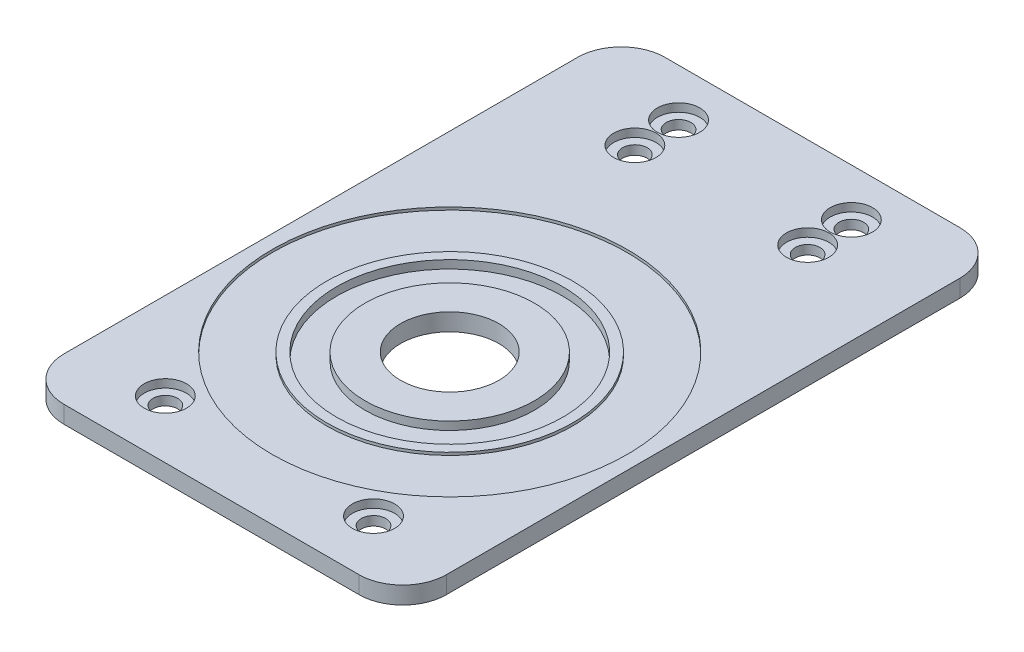
ISO-10303-21;
HEADER;
FILE_DESCRIPTION(('STEP AP214'),'2;1');
FILE_NAME('part.step','',(''),(''),'','','');
FILE_SCHEMA(('AUTOMOTIVE_DESIGN { 1 0 10303 214 1 1 1 1 }'));
ENDSEC;
DATA;
#1=APPLICATION_CONTEXT('core data for automotive mechanical design processes');
#2=APPLICATION_PROTOCOL_DEFINITION('international standard','automotive_design',2000,#1);
#3=PRODUCT_CONTEXT('',#1,'mechanical');
#4=PRODUCT('Part','Part','',(#3));
#5=PRODUCT_RELATED_PRODUCT_CATEGORY('part','',(#4));
#6=PRODUCT_DEFINITION_FORMATION('','',#4);
#7=PRODUCT_DEFINITION_CONTEXT('part definition',#1,'design');
#8=PRODUCT_DEFINITION('design','',#6,#7);
#9=PRODUCT_DEFINITION_SHAPE('','',#8);
#10=(LENGTH_UNIT() NAMED_UNIT(*) SI_UNIT(.MILLI.,.METRE.));
#11=(NAMED_UNIT(*) PLANE_ANGLE_UNIT() SI_UNIT($,.RADIAN.));
#12=(NAMED_UNIT(*) SI_UNIT($,.STERADIAN.) SOLID_ANGLE_UNIT());
#13=UNCERTAINTY_MEASURE_WITH_UNIT(LENGTH_MEASURE(1.E-05),#10,'distance_accuracy_value','');
#14=(GEOMETRIC_REPRESENTATION_CONTEXT(3) GLOBAL_UNCERTAINTY_ASSIGNED_CONTEXT((#13)) GLOBAL_UNIT_ASSIGNED_CONTEXT((#10,
#11,#12)) REPRESENTATION_CONTEXT('',''));
#15=CARTESIAN_POINT('',(0.,0.,0.));
#16=DIRECTION('',(0.,0.,1.));
#17=DIRECTION('',(1.,0.,0.));
#18=AXIS2_PLACEMENT_3D('',#15,#16,#17);
#19=CARTESIAN_POINT('',(15.8125,164.175,-49.7));
#20=DIRECTION('',(0.,1.,0.));
#21=DIRECTION('',(0.,0.,1.));
#22=AXIS2_PLACEMENT_3D('',#19,#20,#21);
#23=CYLINDRICAL_SURFACE('',#22,2.25);
#24=CARTESIAN_POINT('',(15.8125,164.175,-49.7));
#25=DIRECTION('',(0.,1.,0.));
#26=DIRECTION('',(0.,0.,1.));
#27=AXIS2_PLACEMENT_3D('',#24,#25,#26);
#28=CIRCLE('',#27,2.25);
#29=CARTESIAN_POINT('',(15.8125,164.175,-47.45));
#30=VERTEX_POINT('',#29);
#31=EDGE_CURVE('E190',#30,#30,#28,.T.);
#32=ORIENTED_EDGE('',*,*,#31,.F.);
#33=EDGE_LOOP('',(#32));
#34=FACE_BOUND('',#33,.T.);
#35=CARTESIAN_POINT('',(15.8125,165.85,-49.7));
#36=DIRECTION('',(0.,1.,0.));
#37=DIRECTION('',(0.,0.,1.));
#38=AXIS2_PLACEMENT_3D('',#35,#36,#37);
#39=CIRCLE('',#38,2.25);
#40=CARTESIAN_POINT('',(15.8125,165.85,-47.45));
#41=VERTEX_POINT('',#40);
#42=EDGE_CURVE('E238',#41,#41,#39,.F.);
#43=ORIENTED_EDGE('',*,*,#42,.F.);
#44=EDGE_LOOP('',(#43));
#45=FACE_BOUND('',#44,.T.);
#46=ADVANCED_FACE('F39',(#34,#45),#23,.F.);
#47=CARTESIAN_POINT('',(15.8125,164.175,-57.7));
#48=DIRECTION('',(0.,1.,0.));
#49=DIRECTION('',(0.,0.,1.));
#50=AXIS2_PLACEMENT_3D('',#47,#48,#49);
#51=CYLINDRICAL_SURFACE('',#50,2.25);
#52=CARTESIAN_POINT('',(15.8125,164.175,-57.7));
#53=DIRECTION('',(0.,1.,0.));
#54=DIRECTION('',(0.,0.,1.));
#55=AXIS2_PLACEMENT_3D('',#52,#53,#54);
#56=CIRCLE('',#55,2.25);
#57=CARTESIAN_POINT('',(15.8125,164.175,-55.45));
#58=VERTEX_POINT('',#57);
#59=EDGE_CURVE('E195',#58,#58,#56,.T.);
#60=ORIENTED_EDGE('',*,*,#59,.F.);
#61=EDGE_LOOP('',(#60));
#62=FACE_BOUND('',#61,.T.);
#63=CARTESIAN_POINT('',(15.8125,165.85,-57.7));
#64=DIRECTION('',(0.,1.,0.));
#65=DIRECTION('',(0.,0.,1.));
#66=AXIS2_PLACEMENT_3D('',#63,#64,#65);
#67=CIRCLE('',#66,2.25);
#68=CARTESIAN_POINT('',(15.8125,165.85,-55.45));
#69=VERTEX_POINT('',#68);
#70=EDGE_CURVE('E257',#69,#69,#67,.F.);
#71=ORIENTED_EDGE('',*,*,#70,.F.);
#72=EDGE_LOOP('',(#71));
#73=FACE_BOUND('',#72,.T.);
#74=ADVANCED_FACE('F310',(#62,#73),#51,.F.);
#75=CARTESIAN_POINT('',(-15.8125,164.175,-49.7));
#76=DIRECTION('',(0.,1.,0.));
#77=DIRECTION('',(0.,0.,1.));
#78=AXIS2_PLACEMENT_3D('',#75,#76,#77);
#79=CYLINDRICAL_SURFACE('',#78,2.25);
#80=CARTESIAN_POINT('',(-15.8125,164.175,-49.7));
#81=DIRECTION('',(0.,1.,0.));
#82=DIRECTION('',(0.,0.,1.));
#83=AXIS2_PLACEMENT_3D('',#80,#81,#82);
#84=CIRCLE('',#83,2.25);
#85=CARTESIAN_POINT('',(-15.8125,164.175,-47.45));
#86=VERTEX_POINT('',#85);
#87=EDGE_CURVE('E198',#86,#86,#84,.T.);
#88=ORIENTED_EDGE('',*,*,#87,.F.);
#89=EDGE_LOOP('',(#88));
#90=FACE_BOUND('',#89,.T.);
#91=CARTESIAN_POINT('',(-15.8125,165.85,-49.7));
#92=DIRECTION('',(0.,1.,0.));
#93=DIRECTION('',(0.,0.,1.));
#94=AXIS2_PLACEMENT_3D('',#91,#92,#93);
#95=CIRCLE('',#94,2.25);
#96=CARTESIAN_POINT('',(-15.8125,165.85,-47.45));
#97=VERTEX_POINT('',#96);
#98=EDGE_CURVE('E247',#97,#97,#95,.F.);
#99=ORIENTED_EDGE('',*,*,#98,.F.);
#100=EDGE_LOOP('',(#99));
#101=FACE_BOUND('',#100,.T.);
#102=ADVANCED_FACE('F305',(#90,#101),#79,.F.);
#103=CARTESIAN_POINT('',(-15.8125,164.175,-57.7));
#104=DIRECTION('',(0.,1.,0.));
#105=DIRECTION('',(0.,0.,1.));
#106=AXIS2_PLACEMENT_3D('',#103,#104,#105);
#107=CYLINDRICAL_SURFACE('',#106,2.25);
#108=CARTESIAN_POINT('',(-15.8125,164.175,-57.7));
#109=DIRECTION('',(0.,1.,0.));
#110=DIRECTION('',(0.,0.,1.));
#111=AXIS2_PLACEMENT_3D('',#108,#109,#110);
#112=CIRCLE('',#111,2.25);
#113=CARTESIAN_POINT('',(-15.8125,164.175,-55.45));
#114=VERTEX_POINT('',#113);
#115=EDGE_CURVE('E201',#114,#114,#112,.T.);
#116=ORIENTED_EDGE('',*,*,#115,.F.);
#117=EDGE_LOOP('',(#116));
#118=FACE_BOUND('',#117,.T.);
#119=CARTESIAN_POINT('',(-15.8125,165.85,-57.7));
#120=DIRECTION('',(0.,1.,0.));
#121=DIRECTION('',(0.,0.,1.));
#122=AXIS2_PLACEMENT_3D('',#119,#120,#121);
#123=CIRCLE('',#122,2.25);
#124=CARTESIAN_POINT('',(-15.8125,165.85,-55.45));
#125=VERTEX_POINT('',#124);
#126=EDGE_CURVE('E275',#125,#125,#123,.F.);
#127=ORIENTED_EDGE('',*,*,#126,.F.);
#128=EDGE_LOOP('',(#127));
#129=FACE_BOUND('',#128,.T.);
#130=ADVANCED_FACE('F295',(#118,#129),#107,.F.);
#131=CARTESIAN_POINT('',(19.05,164.175,33.));
#132=DIRECTION('',(0.,1.,0.));
#133=DIRECTION('',(0.,0.,1.));
#134=AXIS2_PLACEMENT_3D('',#131,#132,#133);
#135=CYLINDRICAL_SURFACE('',#134,2.25);
#136=CARTESIAN_POINT('',(19.05,164.175,33.));
#137=DIRECTION('',(0.,1.,0.));
#138=DIRECTION('',(0.,0.,1.));
#139=AXIS2_PLACEMENT_3D('',#136,#137,#138);
#140=CIRCLE('',#139,2.25);
#141=CARTESIAN_POINT('',(19.05,164.175,35.25));
#142=VERTEX_POINT('',#141);
#143=EDGE_CURVE('E204',#142,#142,#140,.T.);
#144=ORIENTED_EDGE('',*,*,#143,.F.);
#145=EDGE_LOOP('',(#144));
#146=FACE_BOUND('',#145,.T.);
#147=CARTESIAN_POINT('',(19.05,165.85,33.));
#148=DIRECTION('',(0.,1.,0.));
#149=DIRECTION('',(0.,0.,1.));
#150=AXIS2_PLACEMENT_3D('',#147,#148,#149);
#151=CIRCLE('',#150,2.25);
#152=CARTESIAN_POINT('',(19.05,165.85,35.25));
#153=VERTEX_POINT('',#152);
#154=EDGE_CURVE('E283',#153,#153,#151,.F.);
#155=ORIENTED_EDGE('',*,*,#154,.F.);
#156=EDGE_LOOP('',(#155));
#157=FACE_BOUND('',#156,.T.);
#158=ADVANCED_FACE('F292',(#146,#157),#135,.F.);
#159=CARTESIAN_POINT('',(-19.05,164.175,33.));
#160=DIRECTION('',(0.,1.,0.));
#161=DIRECTION('',(0.,0.,1.));
#162=AXIS2_PLACEMENT_3D('',#159,#160,#161);
#163=CYLINDRICAL_SURFACE('',#162,2.25);
#164=CARTESIAN_POINT('',(-19.05,164.175,33.));
#165=DIRECTION('',(0.,1.,0.));
#166=DIRECTION('',(0.,0.,1.));
#167=AXIS2_PLACEMENT_3D('',#164,#165,#166);
#168=CIRCLE('',#167,2.25);
#169=CARTESIAN_POINT('',(-19.05,164.175,35.25));
#170=VERTEX_POINT('',#169);
#171=EDGE_CURVE('E207',#170,#170,#168,.T.);
#172=ORIENTED_EDGE('',*,*,#171,.F.);
#173=EDGE_LOOP('',(#172));
#174=FACE_BOUND('',#173,.T.);
#175=CARTESIAN_POINT('',(-19.05,165.85,33.));
#176=DIRECTION('',(0.,1.,0.));
#177=DIRECTION('',(0.,0.,1.));
#178=AXIS2_PLACEMENT_3D('',#175,#176,#177);
#179=CIRCLE('',#178,2.25);
#180=CARTESIAN_POINT('',(-19.05,165.85,35.25));
#181=VERTEX_POINT('',#180);
#182=EDGE_CURVE('E265',#181,#181,#179,.F.);
#183=ORIENTED_EDGE('',*,*,#182,.F.);
#184=EDGE_LOOP('',(#183));
#185=FACE_BOUND('',#184,.T.);
#186=ADVANCED_FACE('F294',(#174,#185),#163,.F.);
#187=CARTESIAN_POINT('',(-27.,167.35,35.6));
#188=DIRECTION('',(0.,1.,0.));
#189=DIRECTION('',(0.,0.,1.));
#190=AXIS2_PLACEMENT_3D('',#187,#188,#189);
#191=PLANE('',#190);
#192=CARTESIAN_POINT('',(0.,167.35,0.));
#193=DIRECTION('',(0.,1.,0.));
#194=DIRECTION('',(0.,0.,1.));
#195=AXIS2_PLACEMENT_3D('',#192,#193,#194);
#196=CIRCLE('',#195,9.00000000000001);
#197=CARTESIAN_POINT('',(0.,167.35,9.00000000000001));
#198=VERTEX_POINT('',#197);
#199=EDGE_CURVE('E187',#198,#198,#196,.T.);
#200=ORIENTED_EDGE('',*,*,#199,.F.);
#201=EDGE_LOOP('',(#200));
#202=FACE_BOUND('',#201,.T.);
#203=CARTESIAN_POINT('',(0.,167.35,0.));
#204=DIRECTION('',(0.,1.,0.));
#205=DIRECTION('',(0.,0.,1.));
#206=AXIS2_PLACEMENT_3D('',#203,#204,#205);
#207=CIRCLE('',#206,15.5);
#208=CARTESIAN_POINT('',(0.,167.35,15.5));
#209=VERTEX_POINT('',#208);
#210=EDGE_CURVE('E227',#209,#209,#207,.T.);
#211=ORIENTED_EDGE('',*,*,#210,.T.);
#212=EDGE_LOOP('',(#211));
#213=FACE_BOUND('',#212,.T.);
#214=ADVANCED_FACE('F302',(#202,#213),#191,.T.);
#215=CARTESIAN_POINT('',(0.,167.35,0.));
#216=DIRECTION('',(0.,1.,0.));
#217=DIRECTION('',(0.,0.,1.));
#218=AXIS2_PLACEMENT_3D('',#215,#216,#217);
#219=CIRCLE('',#218,20.701);
#220=CARTESIAN_POINT('',(0.,167.35,20.701));
#221=VERTEX_POINT('',#220);
#222=EDGE_CURVE('E223',#221,#221,#219,.T.);
#223=ORIENTED_EDGE('',*,*,#222,.F.);
#224=EDGE_LOOP('',(#223));
#225=FACE_BOUND('',#224,.T.);
#226=CARTESIAN_POINT('',(0.,167.35,0.));
#227=DIRECTION('',(0.,1.,0.));
#228=DIRECTION('',(0.,0.,1.));
#229=AXIS2_PLACEMENT_3D('',#226,#227,#228);
#230=CIRCLE('',#229,22.5);
#231=CARTESIAN_POINT('',(0.,167.35,22.5));
#232=VERTEX_POINT('',#231);
#233=EDGE_CURVE('E215',#232,#232,#230,.T.);
#234=ORIENTED_EDGE('',*,*,#233,.T.);
#235=EDGE_LOOP('',(#234));
#236=FACE_BOUND('',#235,.T.);
#237=ADVANCED_FACE('F334',(#225,#236),#191,.T.);
#238=CARTESIAN_POINT('',(-27.,164.175,35.6));
#239=DIRECTION('',(0.,1.,0.));
#240=DIRECTION('',(0.,0.,1.));
#241=AXIS2_PLACEMENT_3D('',#238,#239,#240);
#242=CYLINDRICAL_SURFACE('',#241,8.);
#243=CARTESIAN_POINT('',(-27.,167.35,35.6));
#244=DIRECTION('',(0.,1.,0.));
#245=DIRECTION('',(0.,0.,1.));
#246=AXIS2_PLACEMENT_3D('',#243,#244,#245);
#247=CIRCLE('',#246,8.);
#248=CARTESIAN_POINT('',(-35.,167.35,35.6));
#249=VERTEX_POINT('',#248);
#250=CARTESIAN_POINT('',(-27.,167.35,43.6));
#251=VERTEX_POINT('',#250);
#252=EDGE_CURVE('E137',#249,#251,#247,.T.);
#253=ORIENTED_EDGE('',*,*,#252,.F.);
#254=DIRECTION('',(0.,1.,0.));
#255=VECTOR('',#254,1.);
#256=CARTESIAN_POINT('',(-35.,164.175,35.6));
#257=LINE('',#256,#255);
#258=CARTESIAN_POINT('',(-35.,164.175,35.6));
#259=VERTEX_POINT('',#258);
#260=EDGE_CURVE('E11',#259,#249,#257,.T.);
#261=ORIENTED_EDGE('',*,*,#260,.F.);
#262=CARTESIAN_POINT('',(-27.,164.175,35.6));
#263=DIRECTION('',(0.,1.,0.));
#264=DIRECTION('',(0.,0.,1.));
#265=AXIS2_PLACEMENT_3D('',#262,#263,#264);
#266=CIRCLE('',#265,8.);
#267=CARTESIAN_POINT('',(-27.,164.175,43.6));
#268=VERTEX_POINT('',#267);
#269=EDGE_CURVE('E156',#259,#268,#266,.T.);
#270=ORIENTED_EDGE('',*,*,#269,.T.);
#271=DIRECTION('',(0.,1.,0.));
#272=VECTOR('',#271,1.);
#273=CARTESIAN_POINT('',(-27.,164.175,43.6));
#274=LINE('',#273,#272);
#275=EDGE_CURVE('E43',#268,#251,#274,.T.);
#276=ORIENTED_EDGE('',*,*,#275,.T.);
#277=EDGE_LOOP('',(#253,#261,#270,#276));
#278=FACE_BOUND('',#277,.T.);
#279=ADVANCED_FACE('F41',(#278),#242,.T.);
#280=CARTESIAN_POINT('',(-35.,164.175,-43.6));
#281=DIRECTION('',(-1.,0.,0.));
#282=DIRECTION('',(0.,0.,1.));
#283=AXIS2_PLACEMENT_3D('',#280,#281,#282);
#284=PLANE('',#283);
#285=DIRECTION('',(0.,0.,1.));
#286=VECTOR('',#285,1.);
#287=CARTESIAN_POINT('',(-35.,167.35,-43.6));
#288=LINE('',#287,#286);
#289=CARTESIAN_POINT('',(-35.,167.35,-58.4));
#290=VERTEX_POINT('',#289);
#291=EDGE_CURVE('E83',#290,#249,#288,.T.);
#292=ORIENTED_EDGE('',*,*,#291,.F.);
#293=DIRECTION('',(0.,1.,0.));
#294=VECTOR('',#293,1.);
#295=CARTESIAN_POINT('',(-35.,164.175,-58.4));
#296=LINE('',#295,#294);
#297=CARTESIAN_POINT('',(-35.,164.175,-58.4));
#298=VERTEX_POINT('',#297);
#299=EDGE_CURVE('E49',#298,#290,#296,.T.);
#300=ORIENTED_EDGE('',*,*,#299,.F.);
#301=DIRECTION('',(0.,0.,1.));
#302=VECTOR('',#301,1.);
#303=CARTESIAN_POINT('',(-35.,164.175,-43.6));
#304=LINE('',#303,#302);
#305=EDGE_CURVE('E57',#298,#259,#304,.T.);
#306=ORIENTED_EDGE('',*,*,#305,.T.);
#307=ORIENTED_EDGE('',*,*,#260,.T.);
#308=EDGE_LOOP('',(#292,#300,#306,#307));
#309=FACE_BOUND('',#308,.T.);
#310=ADVANCED_FACE('F335',(#309),#284,.T.);
#311=CARTESIAN_POINT('',(-27.,164.175,-58.4));
#312=DIRECTION('',(0.,1.,0.));
#313=DIRECTION('',(0.,0.,1.));
#314=AXIS2_PLACEMENT_3D('',#311,#312,#313);
#315=CYLINDRICAL_SURFACE('',#314,8.);
#316=CARTESIAN_POINT('',(-27.,167.35,-58.4));
#317=DIRECTION('',(0.,1.,0.));
#318=DIRECTION('',(0.,0.,1.));
#319=AXIS2_PLACEMENT_3D('',#316,#317,#318);
#320=CIRCLE('',#319,8.);
#321=CARTESIAN_POINT('',(-27.,167.35,-66.4));
#322=VERTEX_POINT('',#321);
#323=EDGE_CURVE('E114',#322,#290,#320,.T.);
#324=ORIENTED_EDGE('',*,*,#323,.F.);
#325=DIRECTION('',(0.,1.,0.));
#326=VECTOR('',#325,1.);
#327=CARTESIAN_POINT('',(-27.,164.175,-66.4));
#328=LINE('',#327,#326);
#329=CARTESIAN_POINT('',(-27.,164.175,-66.4));
#330=VERTEX_POINT('',#329);
#331=EDGE_CURVE('E109',#330,#322,#328,.T.);
#332=ORIENTED_EDGE('',*,*,#331,.F.);
#333=CARTESIAN_POINT('',(-27.,164.175,-58.4));
#334=DIRECTION('',(0.,1.,0.));
#335=DIRECTION('',(0.,0.,1.));
#336=AXIS2_PLACEMENT_3D('',#333,#334,#335);
#337=CIRCLE('',#336,8.);
#338=EDGE_CURVE('E112',#330,#298,#337,.T.);
#339=ORIENTED_EDGE('',*,*,#338,.T.);
#340=ORIENTED_EDGE('',*,*,#299,.T.);
#341=EDGE_LOOP('',(#324,#332,#339,#340));
#342=FACE_BOUND('',#341,.T.);
#343=ADVANCED_FACE('F111',(#342),#315,.T.);
#344=CARTESIAN_POINT('',(-27.,164.175,-66.4));
#345=DIRECTION('',(0.,0.,-1.));
#346=DIRECTION('',(-1.,0.,0.));
#347=AXIS2_PLACEMENT_3D('',#344,#345,#346);
#348=PLANE('',#347);
#349=DIRECTION('',(-1.,0.,0.));
#350=VECTOR('',#349,1.);
#351=CARTESIAN_POINT('',(-27.,167.35,-66.4));
#352=LINE('',#351,#350);
#353=CARTESIAN_POINT('',(27.,167.35,-66.4));
#354=VERTEX_POINT('',#353);
#355=EDGE_CURVE('E153',#354,#322,#352,.T.);
#356=ORIENTED_EDGE('',*,*,#355,.F.);
#357=DIRECTION('',(0.,1.,0.));
#358=VECTOR('',#357,1.);
#359=CARTESIAN_POINT('',(27.,164.175,-66.4));
#360=LINE('',#359,#358);
#361=CARTESIAN_POINT('',(27.,164.175,-66.4));
#362=VERTEX_POINT('',#361);
#363=EDGE_CURVE('E119',#362,#354,#360,.T.);
#364=ORIENTED_EDGE('',*,*,#363,.F.);
#365=DIRECTION('',(-1.,0.,0.));
#366=VECTOR('',#365,1.);
#367=CARTESIAN_POINT('',(-27.,164.175,-66.4));
#368=LINE('',#367,#366);
#369=EDGE_CURVE('E126',#362,#330,#368,.T.);
#370=ORIENTED_EDGE('',*,*,#369,.T.);
#371=ORIENTED_EDGE('',*,*,#331,.T.);
#372=EDGE_LOOP('',(#356,#364,#370,#371));
#373=FACE_BOUND('',#372,.T.);
#374=ADVANCED_FACE('F129',(#373),#348,.T.);
#375=CARTESIAN_POINT('',(27.,164.175,-58.4));
#376=DIRECTION('',(0.,1.,0.));
#377=DIRECTION('',(0.,0.,1.));
#378=AXIS2_PLACEMENT_3D('',#375,#376,#377);
#379=CYLINDRICAL_SURFACE('',#378,8.);
#380=CARTESIAN_POINT('',(27.,167.35,-58.4));
#381=DIRECTION('',(0.,1.,0.));
#382=DIRECTION('',(0.,0.,1.));
#383=AXIS2_PLACEMENT_3D('',#380,#381,#382);
#384=CIRCLE('',#383,8.);
#385=CARTESIAN_POINT('',(35.,167.35,-58.4));
#386=VERTEX_POINT('',#385);
#387=EDGE_CURVE('E150',#386,#354,#384,.T.);
#388=ORIENTED_EDGE('',*,*,#387,.F.);
#389=DIRECTION('',(0.,1.,0.));
#390=VECTOR('',#389,1.);
#391=CARTESIAN_POINT('',(35.,164.175,-58.4));
#392=LINE('',#391,#390);
#393=CARTESIAN_POINT('',(35.,164.175,-58.4));
#394=VERTEX_POINT('',#393);
#395=EDGE_CURVE('E160',#394,#386,#392,.T.);
#396=ORIENTED_EDGE('',*,*,#395,.F.);
#397=CARTESIAN_POINT('',(27.,164.175,-58.4));
#398=DIRECTION('',(0.,1.,0.));
#399=DIRECTION('',(0.,0.,1.));
#400=AXIS2_PLACEMENT_3D('',#397,#398,#399);
#401=CIRCLE('',#400,8.);
#402=EDGE_CURVE('E130',#394,#362,#401,.T.);
#403=ORIENTED_EDGE('',*,*,#402,.T.);
#404=ORIENTED_EDGE('',*,*,#363,.T.);
#405=EDGE_LOOP('',(#388,#396,#403,#404));
#406=FACE_BOUND('',#405,.T.);
#407=ADVANCED_FACE('F174',(#406),#379,.T.);
#408=CARTESIAN_POINT('',(35.,164.175,-43.6));
#409=DIRECTION('',(1.,0.,0.));
#410=DIRECTION('',(0.,0.,-1.));
#411=AXIS2_PLACEMENT_3D('',#408,#409,#410);
#412=PLANE('',#411);
#413=DIRECTION('',(0.,0.,-1.));
#414=VECTOR('',#413,1.);
#415=CARTESIAN_POINT('',(35.,167.35,-43.6));
#416=LINE('',#415,#414);
#417=CARTESIAN_POINT('',(35.,167.35,35.6));
#418=VERTEX_POINT('',#417);
#419=EDGE_CURVE('E147',#418,#386,#416,.T.);
#420=ORIENTED_EDGE('',*,*,#419,.F.);
#421=DIRECTION('',(0.,1.,0.));
#422=VECTOR('',#421,1.);
#423=CARTESIAN_POINT('',(35.,164.175,35.6));
#424=LINE('',#423,#422);
#425=CARTESIAN_POINT('',(35.,164.175,35.6));
#426=VERTEX_POINT('',#425);
#427=EDGE_CURVE('E162',#426,#418,#424,.T.);
#428=ORIENTED_EDGE('',*,*,#427,.F.);
#429=DIRECTION('',(0.,0.,-1.));
#430=VECTOR('',#429,1.);
#431=CARTESIAN_POINT('',(35.,164.175,-43.6));
#432=LINE('',#431,#430);
#433=EDGE_CURVE('E132',#426,#394,#432,.T.);
#434=ORIENTED_EDGE('',*,*,#433,.T.);
#435=ORIENTED_EDGE('',*,*,#395,.T.);
#436=EDGE_LOOP('',(#420,#428,#434,#435));
#437=FACE_BOUND('',#436,.T.);
#438=ADVANCED_FACE('F344',(#437),#412,.T.);
#439=CARTESIAN_POINT('',(27.,164.175,35.6));
#440=DIRECTION('',(0.,1.,0.));
#441=DIRECTION('',(0.,0.,1.));
#442=AXIS2_PLACEMENT_3D('',#439,#440,#441);
#443=CYLINDRICAL_SURFACE('',#442,8.);
#444=CARTESIAN_POINT('',(27.,167.35,35.6));
#445=DIRECTION('',(0.,1.,0.));
#446=DIRECTION('',(0.,0.,1.));
#447=AXIS2_PLACEMENT_3D('',#444,#445,#446);
#448=CIRCLE('',#447,8.);
#449=CARTESIAN_POINT('',(27.,167.35,43.6));
#450=VERTEX_POINT('',#449);
#451=EDGE_CURVE('E144',#450,#418,#448,.T.);
#452=ORIENTED_EDGE('',*,*,#451,.F.);
#453=DIRECTION('',(0.,1.,0.));
#454=VECTOR('',#453,1.);
#455=CARTESIAN_POINT('',(27.,164.175,43.6));
#456=LINE('',#455,#454);
#457=CARTESIAN_POINT('',(27.,164.175,43.6));
#458=VERTEX_POINT('',#457);
#459=EDGE_CURVE('E164',#458,#450,#456,.T.);
#460=ORIENTED_EDGE('',*,*,#459,.F.);
#461=CARTESIAN_POINT('',(27.,164.175,35.6));
#462=DIRECTION('',(0.,1.,0.));
#463=DIRECTION('',(0.,0.,1.));
#464=AXIS2_PLACEMENT_3D('',#461,#462,#463);
#465=CIRCLE('',#464,8.);
#466=EDGE_CURVE('E178',#458,#426,#465,.T.);
#467=ORIENTED_EDGE('',*,*,#466,.T.);
#468=ORIENTED_EDGE('',*,*,#427,.T.);
#469=EDGE_LOOP('',(#452,#460,#467,#468));
#470=FACE_BOUND('',#469,.T.);
#471=ADVANCED_FACE('F181',(#470),#443,.T.);
#472=CARTESIAN_POINT('',(-27.,164.175,43.6));
#473=DIRECTION('',(0.,0.,1.));
#474=DIRECTION('',(1.,0.,0.));
#475=AXIS2_PLACEMENT_3D('',#472,#473,#474);
#476=PLANE('',#475);
#477=DIRECTION('',(1.,0.,0.));
#478=VECTOR('',#477,1.);
#479=CARTESIAN_POINT('',(-27.,167.35,43.6));
#480=LINE('',#479,#478);
#481=EDGE_CURVE('E140',#251,#450,#480,.T.);
#482=ORIENTED_EDGE('',*,*,#481,.F.);
#483=ORIENTED_EDGE('',*,*,#275,.F.);
#484=DIRECTION('',(1.,0.,0.));
#485=VECTOR('',#484,1.);
#486=CARTESIAN_POINT('',(-27.,164.175,43.6));
#487=LINE('',#486,#485);
#488=EDGE_CURVE('E182',#268,#458,#487,.T.);
#489=ORIENTED_EDGE('',*,*,#488,.T.);
#490=ORIENTED_EDGE('',*,*,#459,.T.);
#491=EDGE_LOOP('',(#482,#483,#489,#490));
#492=FACE_BOUND('',#491,.T.);
#493=ADVANCED_FACE('F168',(#492),#476,.T.);
#494=CARTESIAN_POINT('',(-27.,164.175,35.6));
#495=DIRECTION('',(0.,1.,0.));
#496=DIRECTION('',(0.,0.,1.));
#497=AXIS2_PLACEMENT_3D('',#494,#495,#496);
#498=PLANE('',#497);
#499=ORIENTED_EDGE('',*,*,#171,.T.);
#500=EDGE_LOOP('',(#499));
#501=FACE_BOUND('',#500,.T.);
#502=ORIENTED_EDGE('',*,*,#143,.T.);
#503=EDGE_LOOP('',(#502));
#504=FACE_BOUND('',#503,.T.);
#505=ORIENTED_EDGE('',*,*,#115,.T.);
#506=EDGE_LOOP('',(#505));
#507=FACE_BOUND('',#506,.T.);
#508=ORIENTED_EDGE('',*,*,#87,.T.);
#509=EDGE_LOOP('',(#508));
#510=FACE_BOUND('',#509,.T.);
#511=ORIENTED_EDGE('',*,*,#59,.T.);
#512=EDGE_LOOP('',(#511));
#513=FACE_BOUND('',#512,.T.);
#514=ORIENTED_EDGE('',*,*,#31,.T.);
#515=EDGE_LOOP('',(#514));
#516=FACE_BOUND('',#515,.T.);
#517=CARTESIAN_POINT('',(0.,164.175,0.));
#518=DIRECTION('',(0.,1.,0.));
#519=DIRECTION('',(0.,0.,1.));
#520=AXIS2_PLACEMENT_3D('',#517,#518,#519);
#521=CIRCLE('',#520,9.00000000000001);
#522=CARTESIAN_POINT('',(0.,164.175,9.00000000000001));
#523=VERTEX_POINT('',#522);
#524=EDGE_CURVE('E141',#523,#523,#521,.T.);
#525=ORIENTED_EDGE('',*,*,#524,.T.);
#526=EDGE_LOOP('',(#525));
#527=FACE_BOUND('',#526,.T.);
#528=ORIENTED_EDGE('',*,*,#269,.F.);
#529=ORIENTED_EDGE('',*,*,#305,.F.);
#530=ORIENTED_EDGE('',*,*,#338,.F.);
#531=ORIENTED_EDGE('',*,*,#369,.F.);
#532=ORIENTED_EDGE('',*,*,#402,.F.);
#533=ORIENTED_EDGE('',*,*,#433,.F.);
#534=ORIENTED_EDGE('',*,*,#466,.F.);
#535=ORIENTED_EDGE('',*,*,#488,.F.);
#536=EDGE_LOOP('',(#528,#529,#530,#531,#532,#533,#534,#535));
#537=FACE_BOUND('',#536,.T.);
#538=ADVANCED_FACE('F124',(#501,#504,#507,#510,#513,#516,#527,#537),#498,.F.);
#539=CARTESIAN_POINT('',(-19.05,167.35,33.));
#540=DIRECTION('',(0.,1.,0.));
#541=DIRECTION('',(0.,0.,1.));
#542=AXIS2_PLACEMENT_3D('',#539,#540,#541);
#543=CIRCLE('',#542,3.875);
#544=CARTESIAN_POINT('',(-19.05,167.35,36.875));
#545=VERTEX_POINT('',#544);
#546=EDGE_CURVE('E262',#545,#545,#543,.T.);
#547=ORIENTED_EDGE('',*,*,#546,.F.);
#548=EDGE_LOOP('',(#547));
#549=FACE_BOUND('',#548,.T.);
#550=CARTESIAN_POINT('',(-15.8125,167.35,-57.7));
#551=DIRECTION('',(0.,1.,0.));
#552=DIRECTION('',(0.,0.,1.));
#553=AXIS2_PLACEMENT_3D('',#550,#551,#552);
#554=CIRCLE('',#553,3.875);
#555=CARTESIAN_POINT('',(-15.8125,167.35,-53.825));
#556=VERTEX_POINT('',#555);
#557=EDGE_CURVE('E270',#556,#556,#554,.T.);
#558=ORIENTED_EDGE('',*,*,#557,.F.);
#559=EDGE_LOOP('',(#558));
#560=FACE_BOUND('',#559,.T.);
#561=CARTESIAN_POINT('',(-15.8125,167.35,-49.7));
#562=DIRECTION('',(0.,1.,0.));
#563=DIRECTION('',(0.,0.,1.));
#564=AXIS2_PLACEMENT_3D('',#561,#562,#563);
#565=CIRCLE('',#564,3.875);
#566=CARTESIAN_POINT('',(-15.8125,167.35,-45.825));
#567=VERTEX_POINT('',#566);
#568=EDGE_CURVE('E244',#567,#567,#565,.T.);
#569=ORIENTED_EDGE('',*,*,#568,.F.);
#570=EDGE_LOOP('',(#569));
#571=FACE_BOUND('',#570,.T.);
#572=CARTESIAN_POINT('',(15.8125,167.35,-57.7));
#573=DIRECTION('',(0.,1.,0.));
#574=DIRECTION('',(0.,0.,1.));
#575=AXIS2_PLACEMENT_3D('',#572,#573,#574);
#576=CIRCLE('',#575,3.875);
#577=CARTESIAN_POINT('',(15.8125,167.35,-53.825));
#578=VERTEX_POINT('',#577);
#579=EDGE_CURVE('E252',#578,#578,#576,.T.);
#580=ORIENTED_EDGE('',*,*,#579,.F.);
#581=EDGE_LOOP('',(#580));
#582=FACE_BOUND('',#581,.T.);
#583=CARTESIAN_POINT('',(19.05,167.35,33.));
#584=DIRECTION('',(0.,1.,0.));
#585=DIRECTION('',(0.,0.,1.));
#586=AXIS2_PLACEMENT_3D('',#583,#584,#585);
#587=CIRCLE('',#586,3.87499999999999);
#588=CARTESIAN_POINT('',(19.05,167.35,36.875));
#589=VERTEX_POINT('',#588);
#590=EDGE_CURVE('E280',#589,#589,#587,.T.);
#591=ORIENTED_EDGE('',*,*,#590,.F.);
#592=EDGE_LOOP('',(#591));
#593=FACE_BOUND('',#592,.T.);
#594=CARTESIAN_POINT('',(15.8125,167.35,-49.7));
#595=DIRECTION('',(0.,1.,0.));
#596=DIRECTION('',(0.,0.,1.));
#597=AXIS2_PLACEMENT_3D('',#594,#595,#596);
#598=CIRCLE('',#597,3.875);
#599=CARTESIAN_POINT('',(15.8125,167.35,-45.825));
#600=VERTEX_POINT('',#599);
#601=EDGE_CURVE('E235',#600,#600,#598,.T.);
#602=ORIENTED_EDGE('',*,*,#601,.F.);
#603=EDGE_LOOP('',(#602));
#604=FACE_BOUND('',#603,.T.);
#605=CARTESIAN_POINT('',(0.,167.35,0.));
#606=DIRECTION('',(0.,1.,0.));
#607=DIRECTION('',(0.,0.,1.));
#608=AXIS2_PLACEMENT_3D('',#605,#606,#607);
#609=CIRCLE('',#608,32.5);
#610=CARTESIAN_POINT('',(0.,167.35,32.5));
#611=VERTEX_POINT('',#610);
#612=EDGE_CURVE('E211',#611,#611,#609,.T.);
#613=ORIENTED_EDGE('',*,*,#612,.F.);
#614=EDGE_LOOP('',(#613));
#615=FACE_BOUND('',#614,.T.);
#616=ORIENTED_EDGE('',*,*,#252,.T.);
#617=ORIENTED_EDGE('',*,*,#481,.T.);
#618=ORIENTED_EDGE('',*,*,#451,.T.);
#619=ORIENTED_EDGE('',*,*,#419,.T.);
#620=ORIENTED_EDGE('',*,*,#387,.T.);
#621=ORIENTED_EDGE('',*,*,#355,.T.);
#622=ORIENTED_EDGE('',*,*,#323,.T.);
#623=ORIENTED_EDGE('',*,*,#291,.T.);
#624=EDGE_LOOP('',(#616,#617,#618,#619,#620,#621,#622,#623));
#625=FACE_BOUND('',#624,.T.);
#626=ADVANCED_FACE('F170',(#549,#560,#571,#582,#593,#604,#615,#625),#191,.T.);
#627=CARTESIAN_POINT('',(0.,164.175,0.));
#628=DIRECTION('',(0.,1.,0.));
#629=DIRECTION('',(0.,0.,1.));
#630=AXIS2_PLACEMENT_3D('',#627,#628,#629);
#631=CYLINDRICAL_SURFACE('',#630,9.00000000000001);
#632=ORIENTED_EDGE('',*,*,#524,.F.);
#633=EDGE_LOOP('',(#632));
#634=FACE_BOUND('',#633,.T.);
#635=ORIENTED_EDGE('',*,*,#199,.T.);
#636=EDGE_LOOP('',(#635));
#637=FACE_BOUND('',#636,.T.);
#638=ADVANCED_FACE('F323',(#634,#637),#631,.F.);
#639=CARTESIAN_POINT('',(0.,166.85,0.));
#640=DIRECTION('',(0.,1.,0.));
#641=DIRECTION('',(0.,0.,1.));
#642=AXIS2_PLACEMENT_3D('',#639,#640,#641);
#643=CYLINDRICAL_SURFACE('',#642,22.5);
#644=CARTESIAN_POINT('',(0.,166.85,0.));
#645=DIRECTION('',(0.,1.,0.));
#646=DIRECTION('',(0.,0.,1.));
#647=AXIS2_PLACEMENT_3D('',#644,#645,#646);
#648=CIRCLE('',#647,22.5);
#649=CARTESIAN_POINT('',(0.,166.85,22.5));
#650=VERTEX_POINT('',#649);
#651=EDGE_CURVE('E214',#650,#650,#648,.T.);
#652=ORIENTED_EDGE('',*,*,#651,.T.);
#653=EDGE_LOOP('',(#652));
#654=FACE_BOUND('',#653,.T.);
#655=ORIENTED_EDGE('',*,*,#233,.F.);
#656=EDGE_LOOP('',(#655));
#657=FACE_BOUND('',#656,.T.);
#658=ADVANCED_FACE('F326',(#654,#657),#643,.T.);
#659=CARTESIAN_POINT('',(0.,166.85,0.));
#660=DIRECTION('',(0.,1.,0.));
#661=DIRECTION('',(0.,0.,1.));
#662=AXIS2_PLACEMENT_3D('',#659,#660,#661);
#663=CYLINDRICAL_SURFACE('',#662,32.5);
#664=CARTESIAN_POINT('',(0.,166.85,0.));
#665=DIRECTION('',(0.,1.,0.));
#666=DIRECTION('',(0.,0.,1.));
#667=AXIS2_PLACEMENT_3D('',#664,#665,#666);
#668=CIRCLE('',#667,32.5);
#669=CARTESIAN_POINT('',(0.,166.85,32.5));
#670=VERTEX_POINT('',#669);
#671=EDGE_CURVE('E210',#670,#670,#668,.T.);
#672=ORIENTED_EDGE('',*,*,#671,.F.);
#673=EDGE_LOOP('',(#672));
#674=FACE_BOUND('',#673,.T.);
#675=ORIENTED_EDGE('',*,*,#612,.T.);
#676=EDGE_LOOP('',(#675));
#677=FACE_BOUND('',#676,.T.);
#678=ADVANCED_FACE('F372',(#674,#677),#663,.F.);
#679=CARTESIAN_POINT('',(0.,166.85,0.));
#680=DIRECTION('',(0.,1.,0.));
#681=DIRECTION('',(0.,0.,1.));
#682=AXIS2_PLACEMENT_3D('',#679,#680,#681);
#683=PLANE('',#682);
#684=ORIENTED_EDGE('',*,*,#651,.F.);
#685=EDGE_LOOP('',(#684));
#686=FACE_BOUND('',#685,.T.);
#687=ORIENTED_EDGE('',*,*,#671,.T.);
#688=EDGE_LOOP('',(#687));
#689=FACE_BOUND('',#688,.T.);
#690=ADVANCED_FACE('F381',(#686,#689),#683,.T.);
#691=CARTESIAN_POINT('',(0.,165.85,0.));
#692=DIRECTION('',(0.,1.,0.));
#693=DIRECTION('',(0.,0.,1.));
#694=AXIS2_PLACEMENT_3D('',#691,#692,#693);
#695=CYLINDRICAL_SURFACE('',#694,15.5);
#696=CARTESIAN_POINT('',(0.,165.85,0.));
#697=DIRECTION('',(0.,1.,0.));
#698=DIRECTION('',(0.,0.,1.));
#699=AXIS2_PLACEMENT_3D('',#696,#697,#698);
#700=CIRCLE('',#699,15.5);
#701=CARTESIAN_POINT('',(0.,165.85,15.5));
#702=VERTEX_POINT('',#701);
#703=EDGE_CURVE('E226',#702,#702,#700,.T.);
#704=ORIENTED_EDGE('',*,*,#703,.T.);
#705=EDGE_LOOP('',(#704));
#706=FACE_BOUND('',#705,.T.);
#707=ORIENTED_EDGE('',*,*,#210,.F.);
#708=EDGE_LOOP('',(#707));
#709=FACE_BOUND('',#708,.T.);
#710=ADVANCED_FACE('F390',(#706,#709),#695,.T.);
#711=CARTESIAN_POINT('',(0.,165.85,0.));
#712=DIRECTION('',(0.,1.,0.));
#713=DIRECTION('',(0.,0.,1.));
#714=AXIS2_PLACEMENT_3D('',#711,#712,#713);
#715=CYLINDRICAL_SURFACE('',#714,20.701);
#716=CARTESIAN_POINT('',(0.,165.85,0.));
#717=DIRECTION('',(0.,1.,0.));
#718=DIRECTION('',(0.,0.,1.));
#719=AXIS2_PLACEMENT_3D('',#716,#717,#718);
#720=CIRCLE('',#719,20.701);
#721=CARTESIAN_POINT('',(0.,165.85,20.701));
#722=VERTEX_POINT('',#721);
#723=EDGE_CURVE('E218',#722,#722,#720,.T.);
#724=ORIENTED_EDGE('',*,*,#723,.F.);
#725=EDGE_LOOP('',(#724));
#726=FACE_BOUND('',#725,.T.);
#727=ORIENTED_EDGE('',*,*,#222,.T.);
#728=EDGE_LOOP('',(#727));
#729=FACE_BOUND('',#728,.T.);
#730=ADVANCED_FACE('F412',(#726,#729),#715,.F.);
#731=CARTESIAN_POINT('',(0.,165.85,0.));
#732=DIRECTION('',(0.,1.,0.));
#733=DIRECTION('',(0.,0.,1.));
#734=AXIS2_PLACEMENT_3D('',#731,#732,#733);
#735=PLANE('',#734);
#736=ORIENTED_EDGE('',*,*,#703,.F.);
#737=EDGE_LOOP('',(#736));
#738=FACE_BOUND('',#737,.T.);
#739=ORIENTED_EDGE('',*,*,#723,.T.);
#740=EDGE_LOOP('',(#739));
#741=FACE_BOUND('',#740,.T.);
#742=ADVANCED_FACE('F420',(#738,#741),#735,.T.);
#743=CARTESIAN_POINT('',(-19.05,165.85,33.));
#744=DIRECTION('',(0.,1.,0.));
#745=DIRECTION('',(0.,0.,1.));
#746=AXIS2_PLACEMENT_3D('',#743,#744,#745);
#747=CYLINDRICAL_SURFACE('',#746,3.875);
#748=CARTESIAN_POINT('',(-19.05,165.85,33.));
#749=DIRECTION('',(0.,1.,0.));
#750=DIRECTION('',(0.,0.,1.));
#751=AXIS2_PLACEMENT_3D('',#748,#749,#750);
#752=CIRCLE('',#751,3.875);
#753=CARTESIAN_POINT('',(-19.05,165.85,36.875));
#754=VERTEX_POINT('',#753);
#755=EDGE_CURVE('E267',#754,#754,#752,.T.);
#756=ORIENTED_EDGE('',*,*,#755,.F.);
#757=EDGE_LOOP('',(#756));
#758=FACE_BOUND('',#757,.T.);
#759=ORIENTED_EDGE('',*,*,#546,.T.);
#760=EDGE_LOOP('',(#759));
#761=FACE_BOUND('',#760,.T.);
#762=ADVANCED_FACE('F428',(#758,#761),#747,.F.);
#763=CARTESIAN_POINT('',(0.,165.85,0.));
#764=DIRECTION('',(0.,1.,0.));
#765=DIRECTION('',(0.,0.,1.));
#766=AXIS2_PLACEMENT_3D('',#763,#764,#765);
#767=PLANE('',#766);
#768=ORIENTED_EDGE('',*,*,#182,.T.);
#769=EDGE_LOOP('',(#768));
#770=FACE_BOUND('',#769,.T.);
#771=ORIENTED_EDGE('',*,*,#755,.T.);
#772=EDGE_LOOP('',(#771));
#773=FACE_BOUND('',#772,.T.);
#774=ADVANCED_FACE('F471',(#770,#773),#767,.T.);
#775=CARTESIAN_POINT('',(19.05,165.85,33.));
#776=DIRECTION('',(0.,1.,0.));
#777=DIRECTION('',(0.,0.,1.));
#778=AXIS2_PLACEMENT_3D('',#775,#776,#777);
#779=CYLINDRICAL_SURFACE('',#778,3.87499999999999);
#780=CARTESIAN_POINT('',(19.05,165.85,33.));
#781=DIRECTION('',(0.,1.,0.));
#782=DIRECTION('',(0.,0.,1.));
#783=AXIS2_PLACEMENT_3D('',#780,#781,#782);
#784=CIRCLE('',#783,3.87499999999999);
#785=CARTESIAN_POINT('',(19.05,165.85,36.875));
#786=VERTEX_POINT('',#785);
#787=EDGE_CURVE('E266',#786,#786,#784,.T.);
#788=ORIENTED_EDGE('',*,*,#787,.F.);
#789=EDGE_LOOP('',(#788));
#790=FACE_BOUND('',#789,.T.);
#791=ORIENTED_EDGE('',*,*,#590,.T.);
#792=EDGE_LOOP('',(#791));
#793=FACE_BOUND('',#792,.T.);
#794=ADVANCED_FACE('F481',(#790,#793),#779,.F.);
#795=CARTESIAN_POINT('',(0.,165.85,0.));
#796=DIRECTION('',(0.,1.,0.));
#797=DIRECTION('',(0.,0.,1.));
#798=AXIS2_PLACEMENT_3D('',#795,#796,#797);
#799=PLANE('',#798);
#800=ORIENTED_EDGE('',*,*,#154,.T.);
#801=EDGE_LOOP('',(#800));
#802=FACE_BOUND('',#801,.T.);
#803=ORIENTED_EDGE('',*,*,#787,.T.);
#804=EDGE_LOOP('',(#803));
#805=FACE_BOUND('',#804,.T.);
#806=ADVANCED_FACE('F289',(#802,#805),#799,.T.);
#807=CARTESIAN_POINT('',(-15.8125,165.85,-57.7));
#808=DIRECTION('',(0.,1.,0.));
#809=DIRECTION('',(0.,0.,1.));
#810=AXIS2_PLACEMENT_3D('',#807,#808,#809);
#811=CYLINDRICAL_SURFACE('',#810,3.875);
#812=CARTESIAN_POINT('',(-15.8125,165.85,-57.7));
#813=DIRECTION('',(0.,1.,0.));
#814=DIRECTION('',(0.,0.,1.));
#815=AXIS2_PLACEMENT_3D('',#812,#813,#814);
#816=CIRCLE('',#815,3.875);
#817=CARTESIAN_POINT('',(-15.8125,165.85,-53.825));
#818=VERTEX_POINT('',#817);
#819=EDGE_CURVE('E248',#818,#818,#816,.T.);
#820=ORIENTED_EDGE('',*,*,#819,.F.);
#821=EDGE_LOOP('',(#820));
#822=FACE_BOUND('',#821,.T.);
#823=ORIENTED_EDGE('',*,*,#557,.T.);
#824=EDGE_LOOP('',(#823));
#825=FACE_BOUND('',#824,.T.);
#826=ADVANCED_FACE('F500',(#822,#825),#811,.F.);
#827=CARTESIAN_POINT('',(0.,165.85,0.));
#828=DIRECTION('',(0.,1.,0.));
#829=DIRECTION('',(0.,0.,1.));
#830=AXIS2_PLACEMENT_3D('',#827,#828,#829);
#831=PLANE('',#830);
#832=ORIENTED_EDGE('',*,*,#126,.T.);
#833=EDGE_LOOP('',(#832));
#834=FACE_BOUND('',#833,.T.);
#835=ORIENTED_EDGE('',*,*,#819,.T.);
#836=EDGE_LOOP('',(#835));
#837=FACE_BOUND('',#836,.T.);
#838=ADVANCED_FACE('F509',(#834,#837),#831,.T.);
#839=CARTESIAN_POINT('',(-15.8125,165.85,-49.7));
#840=DIRECTION('',(0.,1.,0.));
#841=DIRECTION('',(0.,0.,1.));
#842=AXIS2_PLACEMENT_3D('',#839,#840,#841);
#843=CYLINDRICAL_SURFACE('',#842,3.875);
#844=CARTESIAN_POINT('',(-15.8125,165.85,-49.7));
#845=DIRECTION('',(0.,1.,0.));
#846=DIRECTION('',(0.,0.,1.));
#847=AXIS2_PLACEMENT_3D('',#844,#845,#846);
#848=CIRCLE('',#847,3.875);
#849=CARTESIAN_POINT('',(-15.8125,165.85,-45.825));
#850=VERTEX_POINT('',#849);
#851=EDGE_CURVE('E249',#850,#850,#848,.T.);
#852=ORIENTED_EDGE('',*,*,#851,.F.);
#853=EDGE_LOOP('',(#852));
#854=FACE_BOUND('',#853,.T.);
#855=ORIENTED_EDGE('',*,*,#568,.T.);
#856=EDGE_LOOP('',(#855));
#857=FACE_BOUND('',#856,.T.);
#858=ADVANCED_FACE('F519',(#854,#857),#843,.F.);
#859=CARTESIAN_POINT('',(0.,165.85,0.));
#860=DIRECTION('',(0.,1.,0.));
#861=DIRECTION('',(0.,0.,1.));
#862=AXIS2_PLACEMENT_3D('',#859,#860,#861);
#863=PLANE('',#862);
#864=ORIENTED_EDGE('',*,*,#98,.T.);
#865=EDGE_LOOP('',(#864));
#866=FACE_BOUND('',#865,.T.);
#867=ORIENTED_EDGE('',*,*,#851,.T.);
#868=EDGE_LOOP('',(#867));
#869=FACE_BOUND('',#868,.T.);
#870=ADVANCED_FACE('F529',(#866,#869),#863,.T.);
#871=CARTESIAN_POINT('',(15.8125,165.85,-57.7));
#872=DIRECTION('',(0.,1.,0.));
#873=DIRECTION('',(0.,0.,1.));
#874=AXIS2_PLACEMENT_3D('',#871,#872,#873);
#875=CYLINDRICAL_SURFACE('',#874,3.875);
#876=CARTESIAN_POINT('',(15.8125,165.85,-57.7));
#877=DIRECTION('',(0.,1.,0.));
#878=DIRECTION('',(0.,0.,1.));
#879=AXIS2_PLACEMENT_3D('',#876,#877,#878);
#880=CIRCLE('',#879,3.875);
#881=CARTESIAN_POINT('',(15.8125,165.85,-53.825));
#882=VERTEX_POINT('',#881);
#883=EDGE_CURVE('E239',#882,#882,#880,.T.);
#884=ORIENTED_EDGE('',*,*,#883,.F.);
#885=EDGE_LOOP('',(#884));
#886=FACE_BOUND('',#885,.T.);
#887=ORIENTED_EDGE('',*,*,#579,.T.);
#888=EDGE_LOOP('',(#887));
#889=FACE_BOUND('',#888,.T.);
#890=ADVANCED_FACE('F539',(#886,#889),#875,.F.);
#891=CARTESIAN_POINT('',(0.,165.85,0.));
#892=DIRECTION('',(0.,1.,0.));
#893=DIRECTION('',(0.,0.,1.));
#894=AXIS2_PLACEMENT_3D('',#891,#892,#893);
#895=PLANE('',#894);
#896=ORIENTED_EDGE('',*,*,#70,.T.);
#897=EDGE_LOOP('',(#896));
#898=FACE_BOUND('',#897,.T.);
#899=ORIENTED_EDGE('',*,*,#883,.T.);
#900=EDGE_LOOP('',(#899));
#901=FACE_BOUND('',#900,.T.);
#902=ADVANCED_FACE('F549',(#898,#901),#895,.T.);
#903=CARTESIAN_POINT('',(15.8125,165.85,-49.7));
#904=DIRECTION('',(0.,1.,0.));
#905=DIRECTION('',(0.,0.,1.));
#906=AXIS2_PLACEMENT_3D('',#903,#904,#905);
#907=CYLINDRICAL_SURFACE('',#906,3.875);
#908=CARTESIAN_POINT('',(15.8125,165.85,-49.7));
#909=DIRECTION('',(0.,1.,0.));
#910=DIRECTION('',(0.,0.,1.));
#911=AXIS2_PLACEMENT_3D('',#908,#909,#910);
#912=CIRCLE('',#911,3.875);
#913=CARTESIAN_POINT('',(15.8125,165.85,-45.825));
#914=VERTEX_POINT('',#913);
#915=EDGE_CURVE('E230',#914,#914,#912,.T.);
#916=ORIENTED_EDGE('',*,*,#915,.F.);
#917=EDGE_LOOP('',(#916));
#918=FACE_BOUND('',#917,.T.);
#919=ORIENTED_EDGE('',*,*,#601,.T.);
#920=EDGE_LOOP('',(#919));
#921=FACE_BOUND('',#920,.T.);
#922=ADVANCED_FACE('F559',(#918,#921),#907,.F.);
#923=CARTESIAN_POINT('',(0.,165.85,0.));
#924=DIRECTION('',(0.,1.,0.));
#925=DIRECTION('',(0.,0.,1.));
#926=AXIS2_PLACEMENT_3D('',#923,#924,#925);
#927=PLANE('',#926);
#928=ORIENTED_EDGE('',*,*,#42,.T.);
#929=EDGE_LOOP('',(#928));
#930=FACE_BOUND('',#929,.T.);
#931=ORIENTED_EDGE('',*,*,#915,.T.);
#932=EDGE_LOOP('',(#931));
#933=FACE_BOUND('',#932,.T.);
#934=ADVANCED_FACE('F569',(#930,#933),#927,.T.);
#935=CLOSED_SHELL('',(#46,#74,#102,#130,#158,#186,#214,#237,#279,#310,#343,#374,#407,#438,#471,
#493,#538,#626,#638,#658,#678,#690,#710,#730,#742,#762,#774,#794,#806,#826,#838,#858,#870,#890,
#902,#922,#934));
#936=MANIFOLD_SOLID_BREP('B2',#935);
#937=ADVANCED_BREP_SHAPE_REPRESENTATION('',(#18,#936),#14);
#938=SHAPE_DEFINITION_REPRESENTATION(#9,#937);
ENDSEC;
END-ISO-10303-21;
